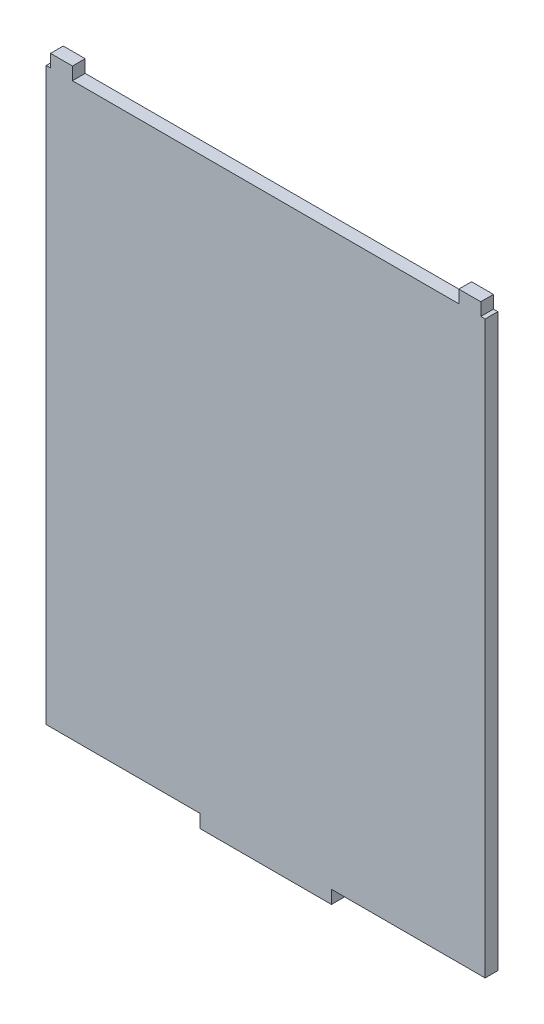
ISO-10303-21;
HEADER;
FILE_DESCRIPTION(('STEP AP214'),'2;1');
FILE_NAME('part.step','',(''),(''),'','','');
FILE_SCHEMA(('AUTOMOTIVE_DESIGN { 1 0 10303 214 1 1 1 1 }'));
ENDSEC;
DATA;
#1=APPLICATION_CONTEXT('core data for automotive mechanical design processes');
#2=APPLICATION_PROTOCOL_DEFINITION('international standard','automotive_design',2000,#1);
#3=PRODUCT_CONTEXT('',#1,'mechanical');
#4=PRODUCT('Part','Part','',(#3));
#5=PRODUCT_RELATED_PRODUCT_CATEGORY('part','',(#4));
#6=PRODUCT_DEFINITION_FORMATION('','',#4);
#7=PRODUCT_DEFINITION_CONTEXT('part definition',#1,'design');
#8=PRODUCT_DEFINITION('design','',#6,#7);
#9=PRODUCT_DEFINITION_SHAPE('','',#8);
#10=(LENGTH_UNIT() NAMED_UNIT(*) SI_UNIT(.MILLI.,.METRE.));
#11=(NAMED_UNIT(*) PLANE_ANGLE_UNIT() SI_UNIT($,.RADIAN.));
#12=(NAMED_UNIT(*) SI_UNIT($,.STERADIAN.) SOLID_ANGLE_UNIT());
#13=UNCERTAINTY_MEASURE_WITH_UNIT(LENGTH_MEASURE(1.E-05),#10,'distance_accuracy_value','');
#14=(GEOMETRIC_REPRESENTATION_CONTEXT(3) GLOBAL_UNCERTAINTY_ASSIGNED_CONTEXT((#13)) GLOBAL_UNIT_ASSIGNED_CONTEXT((#10,
#11,#12)) REPRESENTATION_CONTEXT('',''));
#15=CARTESIAN_POINT('',(0.,0.,0.));
#16=DIRECTION('',(0.,0.,1.));
#17=DIRECTION('',(1.,0.,0.));
#18=AXIS2_PLACEMENT_3D('',#15,#16,#17);
#19=CARTESIAN_POINT('',(0.,0.,2.9));
#20=DIRECTION('',(1.,0.,0.));
#21=DIRECTION('',(0.,0.,-1.));
#22=AXIS2_PLACEMENT_3D('',#19,#20,#21);
#23=PLANE('',#22);
#24=DIRECTION('',(0.,-1.,0.));
#25=VECTOR('',#24,1.);
#26=CARTESIAN_POINT('',(0.,0.,0.));
#27=LINE('',#26,#25);
#28=CARTESIAN_POINT('',(0.,130.,0.));
#29=VERTEX_POINT('',#28);
#30=CARTESIAN_POINT('',(0.,0.,0.));
#31=VERTEX_POINT('',#30);
#32=EDGE_CURVE('E176',#29,#31,#27,.T.);
#33=ORIENTED_EDGE('',*,*,#32,.T.);
#34=DIRECTION('',(0.,0.,-1.));
#35=VECTOR('',#34,1.);
#36=CARTESIAN_POINT('',(0.,0.,2.9));
#37=LINE('',#36,#35);
#38=CARTESIAN_POINT('',(0.,0.,2.9));
#39=VERTEX_POINT('',#38);
#40=EDGE_CURVE('E11',#39,#31,#37,.T.);
#41=ORIENTED_EDGE('',*,*,#40,.F.);
#42=DIRECTION('',(0.,-1.,0.));
#43=VECTOR('',#42,1.);
#44=CARTESIAN_POINT('',(0.,0.,2.9));
#45=LINE('',#44,#43);
#46=CARTESIAN_POINT('',(0.,130.,2.9));
#47=VERTEX_POINT('',#46);
#48=EDGE_CURVE('E209',#47,#39,#45,.T.);
#49=ORIENTED_EDGE('',*,*,#48,.F.);
#50=DIRECTION('',(0.,0.,-1.));
#51=VECTOR('',#50,1.);
#52=CARTESIAN_POINT('',(0.,130.,2.9));
#53=LINE('',#52,#51);
#54=EDGE_CURVE('E172',#47,#29,#53,.T.);
#55=ORIENTED_EDGE('',*,*,#54,.T.);
#56=EDGE_LOOP('',(#33,#41,#49,#55));
#57=FACE_BOUND('',#56,.T.);
#58=ADVANCED_FACE('F33',(#57),#23,.F.);
#59=CARTESIAN_POINT('',(0.,0.,2.9));
#60=DIRECTION('',(0.,1.,0.));
#61=DIRECTION('',(0.,0.,1.));
#62=AXIS2_PLACEMENT_3D('',#59,#60,#61);
#63=PLANE('',#62);
#64=DIRECTION('',(1.,0.,0.));
#65=VECTOR('',#64,1.);
#66=CARTESIAN_POINT('',(0.,0.,0.));
#67=LINE('',#66,#65);
#68=CARTESIAN_POINT('',(35.,0.,0.));
#69=VERTEX_POINT('',#68);
#70=EDGE_CURVE('E179',#31,#69,#67,.T.);
#71=ORIENTED_EDGE('',*,*,#70,.T.);
#72=DIRECTION('',(0.,0.,-1.));
#73=VECTOR('',#72,1.);
#74=CARTESIAN_POINT('',(35.,0.,2.9));
#75=LINE('',#74,#73);
#76=CARTESIAN_POINT('',(35.,0.,2.9));
#77=VERTEX_POINT('',#76);
#78=EDGE_CURVE('E41',#77,#69,#75,.T.);
#79=ORIENTED_EDGE('',*,*,#78,.F.);
#80=DIRECTION('',(1.,0.,0.));
#81=VECTOR('',#80,1.);
#82=CARTESIAN_POINT('',(0.,0.,2.9));
#83=LINE('',#82,#81);
#84=EDGE_CURVE('E116',#39,#77,#83,.T.);
#85=ORIENTED_EDGE('',*,*,#84,.F.);
#86=ORIENTED_EDGE('',*,*,#40,.T.);
#87=EDGE_LOOP('',(#71,#79,#85,#86));
#88=FACE_BOUND('',#87,.T.);
#89=ADVANCED_FACE('F307',(#88),#63,.F.);
#90=CARTESIAN_POINT('',(35.,0.,2.9));
#91=DIRECTION('',(1.,0.,0.));
#92=DIRECTION('',(0.,0.,-1.));
#93=AXIS2_PLACEMENT_3D('',#90,#91,#92);
#94=PLANE('',#93);
#95=DIRECTION('',(0.,-1.,0.));
#96=VECTOR('',#95,1.);
#97=CARTESIAN_POINT('',(35.,0.,0.));
#98=LINE('',#97,#96);
#99=CARTESIAN_POINT('',(35.,-3.,0.));
#100=VERTEX_POINT('',#99);
#101=EDGE_CURVE('E181',#69,#100,#98,.T.);
#102=ORIENTED_EDGE('',*,*,#101,.T.);
#103=DIRECTION('',(0.,0.,-1.));
#104=VECTOR('',#103,1.);
#105=CARTESIAN_POINT('',(35.,-3.,2.9));
#106=LINE('',#105,#104);
#107=CARTESIAN_POINT('',(35.,-3.,2.9));
#108=VERTEX_POINT('',#107);
#109=EDGE_CURVE('E240',#108,#100,#106,.T.);
#110=ORIENTED_EDGE('',*,*,#109,.F.);
#111=DIRECTION('',(0.,-1.,0.));
#112=VECTOR('',#111,1.);
#113=CARTESIAN_POINT('',(35.,0.,2.9));
#114=LINE('',#113,#112);
#115=EDGE_CURVE('E248',#77,#108,#114,.T.);
#116=ORIENTED_EDGE('',*,*,#115,.F.);
#117=ORIENTED_EDGE('',*,*,#78,.T.);
#118=EDGE_LOOP('',(#102,#110,#116,#117));
#119=FACE_BOUND('',#118,.T.);
#120=ADVANCED_FACE('F246',(#119),#94,.F.);
#121=CARTESIAN_POINT('',(50.,-3.,2.9));
#122=DIRECTION('',(0.,1.,0.));
#123=DIRECTION('',(0.,0.,1.));
#124=AXIS2_PLACEMENT_3D('',#121,#122,#123);
#125=PLANE('',#124);
#126=DIRECTION('',(1.,0.,0.));
#127=VECTOR('',#126,1.);
#128=CARTESIAN_POINT('',(50.,-3.,0.));
#129=LINE('',#128,#127);
#130=CARTESIAN_POINT('',(65.,-3.,0.));
#131=VERTEX_POINT('',#130);
#132=EDGE_CURVE('E184',#100,#131,#129,.T.);
#133=ORIENTED_EDGE('',*,*,#132,.T.);
#134=DIRECTION('',(0.,0.,-1.));
#135=VECTOR('',#134,1.);
#136=CARTESIAN_POINT('',(65.,-3.,2.9));
#137=LINE('',#136,#135);
#138=CARTESIAN_POINT('',(65.,-3.,2.9));
#139=VERTEX_POINT('',#138);
#140=EDGE_CURVE('E237',#139,#131,#137,.T.);
#141=ORIENTED_EDGE('',*,*,#140,.F.);
#142=DIRECTION('',(1.,0.,0.));
#143=VECTOR('',#142,1.);
#144=CARTESIAN_POINT('',(50.,-3.,2.9));
#145=LINE('',#144,#143);
#146=EDGE_CURVE('E265',#108,#139,#145,.T.);
#147=ORIENTED_EDGE('',*,*,#146,.F.);
#148=ORIENTED_EDGE('',*,*,#109,.T.);
#149=EDGE_LOOP('',(#133,#141,#147,#148));
#150=FACE_BOUND('',#149,.T.);
#151=ADVANCED_FACE('F256',(#150),#125,.F.);
#152=CARTESIAN_POINT('',(65.,0.,2.9));
#153=DIRECTION('',(-1.,0.,0.));
#154=DIRECTION('',(0.,0.,1.));
#155=AXIS2_PLACEMENT_3D('',#152,#153,#154);
#156=PLANE('',#155);
#157=DIRECTION('',(0.,1.,0.));
#158=VECTOR('',#157,1.);
#159=CARTESIAN_POINT('',(65.,0.,0.));
#160=LINE('',#159,#158);
#161=CARTESIAN_POINT('',(65.,0.,0.));
#162=VERTEX_POINT('',#161);
#163=EDGE_CURVE('E186',#131,#162,#160,.T.);
#164=ORIENTED_EDGE('',*,*,#163,.T.);
#165=DIRECTION('',(0.,0.,-1.));
#166=VECTOR('',#165,1.);
#167=CARTESIAN_POINT('',(65.,0.,2.9));
#168=LINE('',#167,#166);
#169=CARTESIAN_POINT('',(65.,0.,2.9));
#170=VERTEX_POINT('',#169);
#171=EDGE_CURVE('E234',#170,#162,#168,.T.);
#172=ORIENTED_EDGE('',*,*,#171,.F.);
#173=DIRECTION('',(0.,1.,0.));
#174=VECTOR('',#173,1.);
#175=CARTESIAN_POINT('',(65.,0.,2.9));
#176=LINE('',#175,#174);
#177=EDGE_CURVE('E262',#139,#170,#176,.T.);
#178=ORIENTED_EDGE('',*,*,#177,.F.);
#179=ORIENTED_EDGE('',*,*,#140,.T.);
#180=EDGE_LOOP('',(#164,#172,#178,#179));
#181=FACE_BOUND('',#180,.T.);
#182=ADVANCED_FACE('F260',(#181),#156,.F.);
#183=CARTESIAN_POINT('',(65.,0.,2.9));
#184=DIRECTION('',(0.,1.,0.));
#185=DIRECTION('',(0.,0.,1.));
#186=AXIS2_PLACEMENT_3D('',#183,#184,#185);
#187=PLANE('',#186);
#188=DIRECTION('',(1.,0.,0.));
#189=VECTOR('',#188,1.);
#190=CARTESIAN_POINT('',(65.,0.,0.));
#191=LINE('',#190,#189);
#192=CARTESIAN_POINT('',(100.,0.,0.));
#193=VERTEX_POINT('',#192);
#194=EDGE_CURVE('E188',#162,#193,#191,.T.);
#195=ORIENTED_EDGE('',*,*,#194,.T.);
#196=DIRECTION('',(0.,0.,-1.));
#197=VECTOR('',#196,1.);
#198=CARTESIAN_POINT('',(100.,0.,2.9));
#199=LINE('',#198,#197);
#200=CARTESIAN_POINT('',(100.,0.,2.9));
#201=VERTEX_POINT('',#200);
#202=EDGE_CURVE('E231',#201,#193,#199,.T.);
#203=ORIENTED_EDGE('',*,*,#202,.F.);
#204=DIRECTION('',(1.,0.,0.));
#205=VECTOR('',#204,1.);
#206=CARTESIAN_POINT('',(65.,0.,2.9));
#207=LINE('',#206,#205);
#208=EDGE_CURVE('E264',#170,#201,#207,.T.);
#209=ORIENTED_EDGE('',*,*,#208,.F.);
#210=ORIENTED_EDGE('',*,*,#171,.T.);
#211=EDGE_LOOP('',(#195,#203,#209,#210));
#212=FACE_BOUND('',#211,.T.);
#213=ADVANCED_FACE('F320',(#212),#187,.F.);
#214=CARTESIAN_POINT('',(100.,0.,2.9));
#215=DIRECTION('',(-1.,0.,0.));
#216=DIRECTION('',(0.,0.,1.));
#217=AXIS2_PLACEMENT_3D('',#214,#215,#216);
#218=PLANE('',#217);
#219=DIRECTION('',(0.,1.,0.));
#220=VECTOR('',#219,1.);
#221=CARTESIAN_POINT('',(100.,0.,0.));
#222=LINE('',#221,#220);
#223=CARTESIAN_POINT('',(100.,130.,0.));
#224=VERTEX_POINT('',#223);
#225=EDGE_CURVE('E190',#193,#224,#222,.T.);
#226=ORIENTED_EDGE('',*,*,#225,.T.);
#227=DIRECTION('',(0.,0.,-1.));
#228=VECTOR('',#227,1.);
#229=CARTESIAN_POINT('',(100.,130.,2.9));
#230=LINE('',#229,#228);
#231=CARTESIAN_POINT('',(100.,130.,2.9));
#232=VERTEX_POINT('',#231);
#233=EDGE_CURVE('E228',#232,#224,#230,.T.);
#234=ORIENTED_EDGE('',*,*,#233,.F.);
#235=DIRECTION('',(0.,1.,0.));
#236=VECTOR('',#235,1.);
#237=CARTESIAN_POINT('',(100.,0.,2.9));
#238=LINE('',#237,#236);
#239=EDGE_CURVE('E267',#201,#232,#238,.T.);
#240=ORIENTED_EDGE('',*,*,#239,.F.);
#241=ORIENTED_EDGE('',*,*,#202,.T.);
#242=EDGE_LOOP('',(#226,#234,#240,#241));
#243=FACE_BOUND('',#242,.T.);
#244=ADVANCED_FACE('F323',(#243),#218,.F.);
#245=CARTESIAN_POINT('',(100.,130.,2.9));
#246=DIRECTION('',(0.,-1.,0.));
#247=DIRECTION('',(0.,0.,-1.));
#248=AXIS2_PLACEMENT_3D('',#245,#246,#247);
#249=PLANE('',#248);
#250=DIRECTION('',(-1.,0.,0.));
#251=VECTOR('',#250,1.);
#252=CARTESIAN_POINT('',(100.,130.,0.));
#253=LINE('',#252,#251);
#254=CARTESIAN_POINT('',(99.,130.,0.));
#255=VERTEX_POINT('',#254);
#256=EDGE_CURVE('E192',#224,#255,#253,.T.);
#257=ORIENTED_EDGE('',*,*,#256,.T.);
#258=DIRECTION('',(0.,0.,-1.));
#259=VECTOR('',#258,1.);
#260=CARTESIAN_POINT('',(99.,130.,2.9));
#261=LINE('',#260,#259);
#262=CARTESIAN_POINT('',(99.,130.,2.9));
#263=VERTEX_POINT('',#262);
#264=EDGE_CURVE('E225',#263,#255,#261,.T.);
#265=ORIENTED_EDGE('',*,*,#264,.F.);
#266=DIRECTION('',(-1.,0.,0.));
#267=VECTOR('',#266,1.);
#268=CARTESIAN_POINT('',(100.,130.,2.9));
#269=LINE('',#268,#267);
#270=EDGE_CURVE('E273',#232,#263,#269,.T.);
#271=ORIENTED_EDGE('',*,*,#270,.F.);
#272=ORIENTED_EDGE('',*,*,#233,.T.);
#273=EDGE_LOOP('',(#257,#265,#271,#272));
#274=FACE_BOUND('',#273,.T.);
#275=ADVANCED_FACE('F327',(#274),#249,.F.);
#276=CARTESIAN_POINT('',(99.,130.,2.9));
#277=DIRECTION('',(-1.,0.,0.));
#278=DIRECTION('',(0.,0.,1.));
#279=AXIS2_PLACEMENT_3D('',#276,#277,#278);
#280=PLANE('',#279);
#281=DIRECTION('',(0.,1.,0.));
#282=VECTOR('',#281,1.);
#283=CARTESIAN_POINT('',(99.,130.,0.));
#284=LINE('',#283,#282);
#285=CARTESIAN_POINT('',(99.,132.9,0.));
#286=VERTEX_POINT('',#285);
#287=EDGE_CURVE('E194',#255,#286,#284,.T.);
#288=ORIENTED_EDGE('',*,*,#287,.T.);
#289=DIRECTION('',(0.,0.,-1.));
#290=VECTOR('',#289,1.);
#291=CARTESIAN_POINT('',(99.,132.9,2.9));
#292=LINE('',#291,#290);
#293=CARTESIAN_POINT('',(99.,132.9,2.9));
#294=VERTEX_POINT('',#293);
#295=EDGE_CURVE('E222',#294,#286,#292,.T.);
#296=ORIENTED_EDGE('',*,*,#295,.F.);
#297=DIRECTION('',(0.,1.,0.));
#298=VECTOR('',#297,1.);
#299=CARTESIAN_POINT('',(99.,130.,2.9));
#300=LINE('',#299,#298);
#301=EDGE_CURVE('E275',#263,#294,#300,.T.);
#302=ORIENTED_EDGE('',*,*,#301,.F.);
#303=ORIENTED_EDGE('',*,*,#264,.T.);
#304=EDGE_LOOP('',(#288,#296,#302,#303));
#305=FACE_BOUND('',#304,.T.);
#306=ADVANCED_FACE('F331',(#305),#280,.F.);
#307=CARTESIAN_POINT('',(95.,132.9,2.9));
#308=DIRECTION('',(0.,-1.,0.));
#309=DIRECTION('',(1.,0.,0.));
#310=AXIS2_PLACEMENT_3D('',#307,#308,#309);
#311=PLANE('',#310);
#312=DIRECTION('',(-1.,0.,0.));
#313=VECTOR('',#312,1.);
#314=CARTESIAN_POINT('',(95.,132.9,0.));
#315=LINE('',#314,#313);
#316=CARTESIAN_POINT('',(94.,132.9,0.));
#317=VERTEX_POINT('',#316);
#318=EDGE_CURVE('E197',#286,#317,#315,.T.);
#319=ORIENTED_EDGE('',*,*,#318,.T.);
#320=DIRECTION('',(0.,0.,-1.));
#321=VECTOR('',#320,1.);
#322=CARTESIAN_POINT('',(94.,132.9,2.9));
#323=LINE('',#322,#321);
#324=CARTESIAN_POINT('',(94.,132.9,2.9));
#325=VERTEX_POINT('',#324);
#326=EDGE_CURVE('E219',#325,#317,#323,.T.);
#327=ORIENTED_EDGE('',*,*,#326,.F.);
#328=DIRECTION('',(-1.,0.,0.));
#329=VECTOR('',#328,1.);
#330=CARTESIAN_POINT('',(99.,132.9,2.9));
#331=LINE('',#330,#329);
#332=EDGE_CURVE('E277',#294,#325,#331,.T.);
#333=ORIENTED_EDGE('',*,*,#332,.F.);
#334=ORIENTED_EDGE('',*,*,#295,.T.);
#335=EDGE_LOOP('',(#319,#327,#333,#334));
#336=FACE_BOUND('',#335,.T.);
#337=ADVANCED_FACE('F335',(#336),#311,.F.);
#338=CARTESIAN_POINT('',(94.,130.,2.9));
#339=DIRECTION('',(1.,0.,0.));
#340=DIRECTION('',(0.,0.,-1.));
#341=AXIS2_PLACEMENT_3D('',#338,#339,#340);
#342=PLANE('',#341);
#343=DIRECTION('',(0.,-1.,0.));
#344=VECTOR('',#343,1.);
#345=CARTESIAN_POINT('',(94.,130.,0.));
#346=LINE('',#345,#344);
#347=CARTESIAN_POINT('',(94.,130.,0.));
#348=VERTEX_POINT('',#347);
#349=EDGE_CURVE('E199',#317,#348,#346,.T.);
#350=ORIENTED_EDGE('',*,*,#349,.T.);
#351=DIRECTION('',(0.,0.,-1.));
#352=VECTOR('',#351,1.);
#353=CARTESIAN_POINT('',(94.,130.,2.9));
#354=LINE('',#353,#352);
#355=CARTESIAN_POINT('',(94.,130.,2.9));
#356=VERTEX_POINT('',#355);
#357=EDGE_CURVE('E216',#356,#348,#354,.T.);
#358=ORIENTED_EDGE('',*,*,#357,.F.);
#359=DIRECTION('',(0.,-1.,0.));
#360=VECTOR('',#359,1.);
#361=CARTESIAN_POINT('',(94.,130.,2.9));
#362=LINE('',#361,#360);
#363=EDGE_CURVE('E279',#325,#356,#362,.T.);
#364=ORIENTED_EDGE('',*,*,#363,.F.);
#365=ORIENTED_EDGE('',*,*,#326,.T.);
#366=EDGE_LOOP('',(#350,#358,#364,#365));
#367=FACE_BOUND('',#366,.T.);
#368=ADVANCED_FACE('F339',(#367),#342,.F.);
#369=CARTESIAN_POINT('',(6.,130.,2.9));
#370=DIRECTION('',(0.,-1.,0.));
#371=DIRECTION('',(0.,0.,-1.));
#372=AXIS2_PLACEMENT_3D('',#369,#370,#371);
#373=PLANE('',#372);
#374=DIRECTION('',(-1.,0.,0.));
#375=VECTOR('',#374,1.);
#376=CARTESIAN_POINT('',(6.,130.,0.));
#377=LINE('',#376,#375);
#378=CARTESIAN_POINT('',(6.,130.,0.));
#379=VERTEX_POINT('',#378);
#380=EDGE_CURVE('E201',#348,#379,#377,.T.);
#381=ORIENTED_EDGE('',*,*,#380,.T.);
#382=DIRECTION('',(0.,0.,-1.));
#383=VECTOR('',#382,1.);
#384=CARTESIAN_POINT('',(6.,130.,2.9));
#385=LINE('',#384,#383);
#386=CARTESIAN_POINT('',(6.,130.,2.9));
#387=VERTEX_POINT('',#386);
#388=EDGE_CURVE('E213',#387,#379,#385,.T.);
#389=ORIENTED_EDGE('',*,*,#388,.F.);
#390=DIRECTION('',(-1.,0.,0.));
#391=VECTOR('',#390,1.);
#392=CARTESIAN_POINT('',(6.,130.,2.9));
#393=LINE('',#392,#391);
#394=EDGE_CURVE('E281',#356,#387,#393,.T.);
#395=ORIENTED_EDGE('',*,*,#394,.F.);
#396=ORIENTED_EDGE('',*,*,#357,.T.);
#397=EDGE_LOOP('',(#381,#389,#395,#396));
#398=FACE_BOUND('',#397,.T.);
#399=ADVANCED_FACE('F287',(#398),#373,.F.);
#400=CARTESIAN_POINT('',(6.,130.,2.9));
#401=DIRECTION('',(-1.,0.,0.));
#402=DIRECTION('',(0.,0.,1.));
#403=AXIS2_PLACEMENT_3D('',#400,#401,#402);
#404=PLANE('',#403);
#405=DIRECTION('',(0.,1.,0.));
#406=VECTOR('',#405,1.);
#407=CARTESIAN_POINT('',(6.,130.,0.));
#408=LINE('',#407,#406);
#409=CARTESIAN_POINT('',(6.,132.9,0.));
#410=VERTEX_POINT('',#409);
#411=EDGE_CURVE('E203',#379,#410,#408,.T.);
#412=ORIENTED_EDGE('',*,*,#411,.T.);
#413=DIRECTION('',(0.,0.,-1.));
#414=VECTOR('',#413,1.);
#415=CARTESIAN_POINT('',(6.,132.9,2.9));
#416=LINE('',#415,#414);
#417=CARTESIAN_POINT('',(6.,132.9,2.9));
#418=VERTEX_POINT('',#417);
#419=EDGE_CURVE('E167',#418,#410,#416,.T.);
#420=ORIENTED_EDGE('',*,*,#419,.F.);
#421=DIRECTION('',(0.,1.,0.));
#422=VECTOR('',#421,1.);
#423=CARTESIAN_POINT('',(6.,130.,2.9));
#424=LINE('',#423,#422);
#425=EDGE_CURVE('E159',#387,#418,#424,.T.);
#426=ORIENTED_EDGE('',*,*,#425,.F.);
#427=ORIENTED_EDGE('',*,*,#388,.T.);
#428=EDGE_LOOP('',(#412,#420,#426,#427));
#429=FACE_BOUND('',#428,.T.);
#430=ADVANCED_FACE('F291',(#429),#404,.F.);
#431=CARTESIAN_POINT('',(1.,132.9,2.9));
#432=DIRECTION('',(0.,-1.,0.));
#433=DIRECTION('',(0.,0.,-1.));
#434=AXIS2_PLACEMENT_3D('',#431,#432,#433);
#435=PLANE('',#434);
#436=DIRECTION('',(-1.,0.,0.));
#437=VECTOR('',#436,1.);
#438=CARTESIAN_POINT('',(1.,132.9,0.));
#439=LINE('',#438,#437);
#440=CARTESIAN_POINT('',(1.,132.9,0.));
#441=VERTEX_POINT('',#440);
#442=EDGE_CURVE('E166',#410,#441,#439,.T.);
#443=ORIENTED_EDGE('',*,*,#442,.T.);
#444=DIRECTION('',(0.,0.,-1.));
#445=VECTOR('',#444,1.);
#446=CARTESIAN_POINT('',(1.,132.9,2.9));
#447=LINE('',#446,#445);
#448=CARTESIAN_POINT('',(1.,132.9,2.9));
#449=VERTEX_POINT('',#448);
#450=EDGE_CURVE('E164',#449,#441,#447,.T.);
#451=ORIENTED_EDGE('',*,*,#450,.F.);
#452=DIRECTION('',(-1.,0.,0.));
#453=VECTOR('',#452,1.);
#454=CARTESIAN_POINT('',(5.,132.9,2.9));
#455=LINE('',#454,#453);
#456=EDGE_CURVE('E153',#418,#449,#455,.T.);
#457=ORIENTED_EDGE('',*,*,#456,.F.);
#458=ORIENTED_EDGE('',*,*,#419,.T.);
#459=EDGE_LOOP('',(#443,#451,#457,#458));
#460=FACE_BOUND('',#459,.T.);
#461=ADVANCED_FACE('F165',(#460),#435,.F.);
#462=CARTESIAN_POINT('',(1.,130.,2.9));
#463=DIRECTION('',(1.,0.,0.));
#464=DIRECTION('',(0.,0.,-1.));
#465=AXIS2_PLACEMENT_3D('',#462,#463,#464);
#466=PLANE('',#465);
#467=DIRECTION('',(0.,-1.,0.));
#468=VECTOR('',#467,1.);
#469=CARTESIAN_POINT('',(1.,130.,0.));
#470=LINE('',#469,#468);
#471=CARTESIAN_POINT('',(1.,130.,0.));
#472=VERTEX_POINT('',#471);
#473=EDGE_CURVE('E102',#441,#472,#470,.T.);
#474=ORIENTED_EDGE('',*,*,#473,.T.);
#475=DIRECTION('',(0.,0.,-1.));
#476=VECTOR('',#475,1.);
#477=CARTESIAN_POINT('',(1.,130.,2.9));
#478=LINE('',#477,#476);
#479=CARTESIAN_POINT('',(1.,130.,2.9));
#480=VERTEX_POINT('',#479);
#481=EDGE_CURVE('E168',#480,#472,#478,.T.);
#482=ORIENTED_EDGE('',*,*,#481,.F.);
#483=DIRECTION('',(0.,-1.,0.));
#484=VECTOR('',#483,1.);
#485=CARTESIAN_POINT('',(1.,130.,2.9));
#486=LINE('',#485,#484);
#487=EDGE_CURVE('E157',#449,#480,#486,.T.);
#488=ORIENTED_EDGE('',*,*,#487,.F.);
#489=ORIENTED_EDGE('',*,*,#450,.T.);
#490=EDGE_LOOP('',(#474,#482,#488,#489));
#491=FACE_BOUND('',#490,.T.);
#492=ADVANCED_FACE('F170',(#491),#466,.F.);
#493=CARTESIAN_POINT('',(0.,130.,2.9));
#494=DIRECTION('',(0.,-1.,0.));
#495=DIRECTION('',(0.,0.,-1.));
#496=AXIS2_PLACEMENT_3D('',#493,#494,#495);
#497=PLANE('',#496);
#498=DIRECTION('',(-1.,0.,0.));
#499=VECTOR('',#498,1.);
#500=CARTESIAN_POINT('',(0.,130.,0.));
#501=LINE('',#500,#499);
#502=EDGE_CURVE('E108',#472,#29,#501,.T.);
#503=ORIENTED_EDGE('',*,*,#502,.T.);
#504=ORIENTED_EDGE('',*,*,#54,.F.);
#505=DIRECTION('',(-1.,0.,0.));
#506=VECTOR('',#505,1.);
#507=CARTESIAN_POINT('',(0.,130.,2.9));
#508=LINE('',#507,#506);
#509=EDGE_CURVE('E49',#480,#47,#508,.T.);
#510=ORIENTED_EDGE('',*,*,#509,.F.);
#511=ORIENTED_EDGE('',*,*,#481,.T.);
#512=EDGE_LOOP('',(#503,#504,#510,#511));
#513=FACE_BOUND('',#512,.T.);
#514=ADVANCED_FACE('F296',(#513),#497,.F.);
#515=CARTESIAN_POINT('',(0.,0.,2.9));
#516=DIRECTION('',(0.,0.,-1.));
#517=DIRECTION('',(-1.,0.,0.));
#518=AXIS2_PLACEMENT_3D('',#515,#516,#517);
#519=PLANE('',#518);
#520=ORIENTED_EDGE('',*,*,#48,.T.);
#521=ORIENTED_EDGE('',*,*,#84,.T.);
#522=ORIENTED_EDGE('',*,*,#115,.T.);
#523=ORIENTED_EDGE('',*,*,#146,.T.);
#524=ORIENTED_EDGE('',*,*,#177,.T.);
#525=ORIENTED_EDGE('',*,*,#208,.T.);
#526=ORIENTED_EDGE('',*,*,#239,.T.);
#527=ORIENTED_EDGE('',*,*,#270,.T.);
#528=ORIENTED_EDGE('',*,*,#301,.T.);
#529=ORIENTED_EDGE('',*,*,#332,.T.);
#530=ORIENTED_EDGE('',*,*,#363,.T.);
#531=ORIENTED_EDGE('',*,*,#394,.T.);
#532=ORIENTED_EDGE('',*,*,#425,.T.);
#533=ORIENTED_EDGE('',*,*,#456,.T.);
#534=ORIENTED_EDGE('',*,*,#487,.T.);
#535=ORIENTED_EDGE('',*,*,#509,.T.);
#536=EDGE_LOOP('',(#520,#521,#522,#523,#524,#525,#526,#527,#528,#529,#530,#531,#532,#533,#534,#535));
#537=FACE_BOUND('',#536,.T.);
#538=ADVANCED_FACE('F155',(#537),#519,.F.);
#539=CARTESIAN_POINT('',(0.,0.,0.));
#540=DIRECTION('',(0.,0.,-1.));
#541=DIRECTION('',(-1.,0.,0.));
#542=AXIS2_PLACEMENT_3D('',#539,#540,#541);
#543=PLANE('',#542);
#544=ORIENTED_EDGE('',*,*,#32,.F.);
#545=ORIENTED_EDGE('',*,*,#502,.F.);
#546=ORIENTED_EDGE('',*,*,#473,.F.);
#547=ORIENTED_EDGE('',*,*,#442,.F.);
#548=ORIENTED_EDGE('',*,*,#411,.F.);
#549=ORIENTED_EDGE('',*,*,#380,.F.);
#550=ORIENTED_EDGE('',*,*,#349,.F.);
#551=ORIENTED_EDGE('',*,*,#318,.F.);
#552=ORIENTED_EDGE('',*,*,#287,.F.);
#553=ORIENTED_EDGE('',*,*,#256,.F.);
#554=ORIENTED_EDGE('',*,*,#225,.F.);
#555=ORIENTED_EDGE('',*,*,#194,.F.);
#556=ORIENTED_EDGE('',*,*,#163,.F.);
#557=ORIENTED_EDGE('',*,*,#132,.F.);
#558=ORIENTED_EDGE('',*,*,#101,.F.);
#559=ORIENTED_EDGE('',*,*,#70,.F.);
#560=EDGE_LOOP('',(#544,#545,#546,#547,#548,#549,#550,#551,#552,#553,#554,#555,#556,#557,#558,#559));
#561=FACE_BOUND('',#560,.T.);
#562=ADVANCED_FACE('F251',(#561),#543,.T.);
#563=CLOSED_SHELL('',(#58,#89,#120,#151,#182,#213,#244,#275,#306,#337,#368,#399,#430,#461,#492,
#514,#538,#562));
#564=MANIFOLD_SOLID_BREP('B2',#563);
#565=ADVANCED_BREP_SHAPE_REPRESENTATION('',(#18,#564),#14);
#566=SHAPE_DEFINITION_REPRESENTATION(#9,#565);
ENDSEC;
END-ISO-10303-21;
